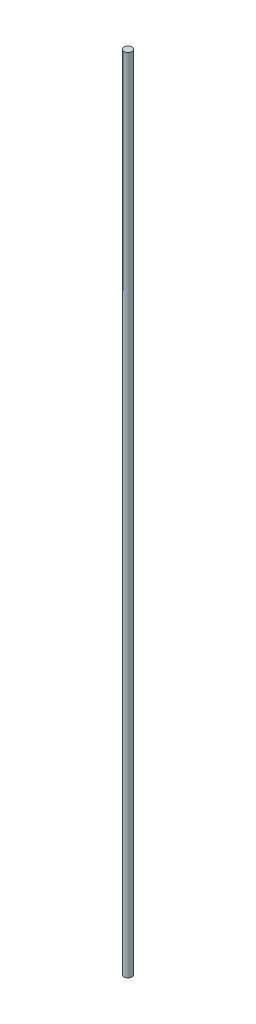
ISO-10303-21;
HEADER;
FILE_DESCRIPTION(('STEP AP214'),'2;1');
FILE_NAME('part.step','',(''),(''),'','','');
FILE_SCHEMA(('AUTOMOTIVE_DESIGN { 1 0 10303 214 1 1 1 1 }'));
ENDSEC;
DATA;
#1=APPLICATION_CONTEXT('core data for automotive mechanical design processes');
#2=APPLICATION_PROTOCOL_DEFINITION('international standard','automotive_design',2000,#1);
#3=PRODUCT_CONTEXT('',#1,'mechanical');
#4=PRODUCT('Part','Part','',(#3));
#5=PRODUCT_RELATED_PRODUCT_CATEGORY('part','',(#4));
#6=PRODUCT_DEFINITION_FORMATION('','',#4);
#7=PRODUCT_DEFINITION_CONTEXT('part definition',#1,'design');
#8=PRODUCT_DEFINITION('design','',#6,#7);
#9=PRODUCT_DEFINITION_SHAPE('','',#8);
#10=(LENGTH_UNIT() NAMED_UNIT(*) SI_UNIT(.MILLI.,.METRE.));
#11=(NAMED_UNIT(*) PLANE_ANGLE_UNIT() SI_UNIT($,.RADIAN.));
#12=(NAMED_UNIT(*) SI_UNIT($,.STERADIAN.) SOLID_ANGLE_UNIT());
#13=UNCERTAINTY_MEASURE_WITH_UNIT(LENGTH_MEASURE(1.E-05),#10,'distance_accuracy_value','');
#14=(GEOMETRIC_REPRESENTATION_CONTEXT(3) GLOBAL_UNCERTAINTY_ASSIGNED_CONTEXT((#13)) GLOBAL_UNIT_ASSIGNED_CONTEXT((#10,
#11,#12)) REPRESENTATION_CONTEXT('',''));
#15=CARTESIAN_POINT('',(0.,0.,0.));
#16=DIRECTION('',(0.,0.,1.));
#17=DIRECTION('',(1.,0.,0.));
#18=AXIS2_PLACEMENT_3D('',#15,#16,#17);
#19=CARTESIAN_POINT('',(0.,300.,0.));
#20=DIRECTION('',(0.,-1.,0.));
#21=DIRECTION('',(0.,0.,-1.));
#22=AXIS2_PLACEMENT_3D('',#19,#20,#21);
#23=CYLINDRICAL_SURFACE('',#22,1.5);
#24=CARTESIAN_POINT('',(0.,300.,0.));
#25=DIRECTION('',(0.,1.,0.));
#26=DIRECTION('',(0.,0.,1.));
#27=AXIS2_PLACEMENT_3D('',#24,#25,#26);
#28=CIRCLE('',#27,1.5);
#29=CARTESIAN_POINT('',(0.,300.,1.5));
#30=VERTEX_POINT('',#29);
#31=EDGE_CURVE('E10',#30,#30,#28,.T.);
#32=ORIENTED_EDGE('',*,*,#31,.F.);
#33=EDGE_LOOP('',(#32));
#34=FACE_BOUND('',#33,.T.);
#35=CARTESIAN_POINT('',(0.,0.,0.));
#36=DIRECTION('',(0.,1.,0.));
#37=DIRECTION('',(0.,0.,1.));
#38=AXIS2_PLACEMENT_3D('',#35,#36,#37);
#39=CIRCLE('',#38,1.5);
#40=CARTESIAN_POINT('',(0.,0.,1.5));
#41=VERTEX_POINT('',#40);
#42=EDGE_CURVE('E33',#41,#41,#39,.T.);
#43=ORIENTED_EDGE('',*,*,#42,.T.);
#44=EDGE_LOOP('',(#43));
#45=FACE_BOUND('',#44,.T.);
#46=ADVANCED_FACE('F30',(#34,#45),#23,.T.);
#47=CARTESIAN_POINT('',(0.,300.,0.));
#48=DIRECTION('',(0.,1.,0.));
#49=DIRECTION('',(0.,0.,1.));
#50=AXIS2_PLACEMENT_3D('',#47,#48,#49);
#51=PLANE('',#50);
#52=ORIENTED_EDGE('',*,*,#31,.T.);
#53=EDGE_LOOP('',(#52));
#54=FACE_BOUND('',#53,.T.);
#55=ADVANCED_FACE('F45',(#54),#51,.T.);
#56=CARTESIAN_POINT('',(0.,0.,0.));
#57=DIRECTION('',(0.,1.,0.));
#58=DIRECTION('',(0.,0.,1.));
#59=AXIS2_PLACEMENT_3D('',#56,#57,#58);
#60=PLANE('',#59);
#61=ORIENTED_EDGE('',*,*,#42,.F.);
#62=EDGE_LOOP('',(#61));
#63=FACE_BOUND('',#62,.T.);
#64=ADVANCED_FACE('F43',(#63),#60,.F.);
#65=CLOSED_SHELL('',(#46,#55,#64));
#66=MANIFOLD_SOLID_BREP('B2',#65);
#67=ADVANCED_BREP_SHAPE_REPRESENTATION('',(#18,#66),#14);
#68=SHAPE_DEFINITION_REPRESENTATION(#9,#67);
ENDSEC;
END-ISO-10303-21;
